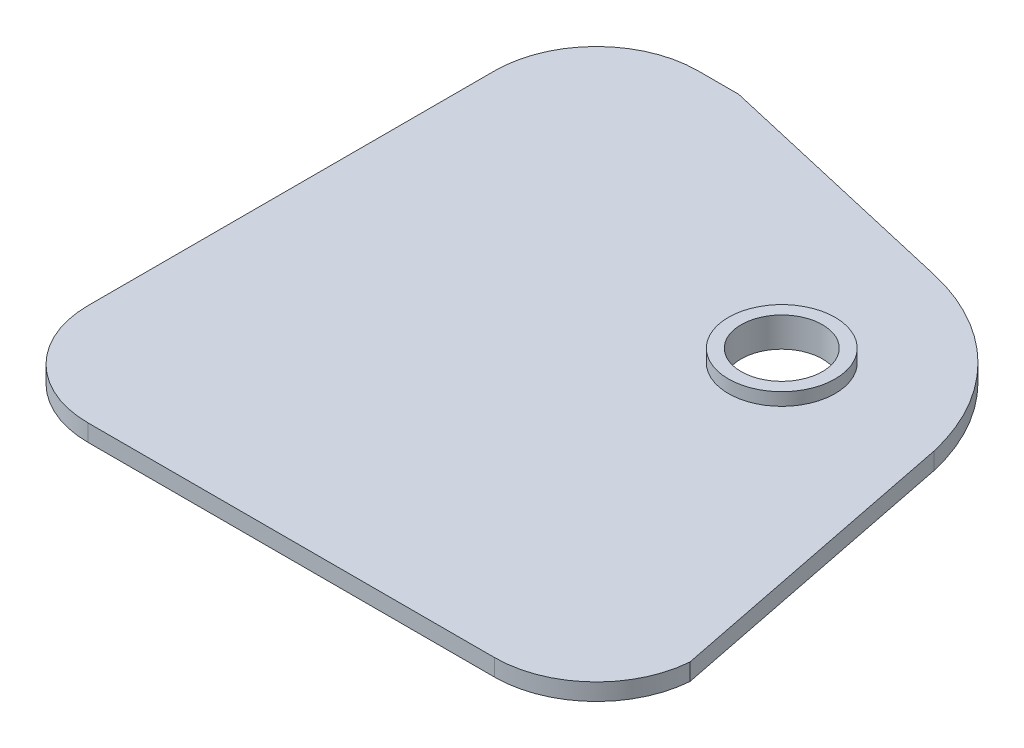
ISO-10303-21;
HEADER;
FILE_DESCRIPTION(('STEP AP214'),'2;1');
FILE_NAME('part.step','',(''),(''),'','','');
FILE_SCHEMA(('AUTOMOTIVE_DESIGN { 1 0 10303 214 1 1 1 1 }'));
ENDSEC;
DATA;
#1=APPLICATION_CONTEXT('core data for automotive mechanical design processes');
#2=APPLICATION_PROTOCOL_DEFINITION('international standard','automotive_design',2000,#1);
#3=PRODUCT_CONTEXT('',#1,'mechanical');
#4=PRODUCT('Part','Part','',(#3));
#5=PRODUCT_RELATED_PRODUCT_CATEGORY('part','',(#4));
#6=PRODUCT_DEFINITION_FORMATION('','',#4);
#7=PRODUCT_DEFINITION_CONTEXT('part definition',#1,'design');
#8=PRODUCT_DEFINITION('design','',#6,#7);
#9=PRODUCT_DEFINITION_SHAPE('','',#8);
#10=(LENGTH_UNIT() NAMED_UNIT(*) SI_UNIT(.MILLI.,.METRE.));
#11=(NAMED_UNIT(*) PLANE_ANGLE_UNIT() SI_UNIT($,.RADIAN.));
#12=(NAMED_UNIT(*) SI_UNIT($,.STERADIAN.) SOLID_ANGLE_UNIT());
#13=UNCERTAINTY_MEASURE_WITH_UNIT(LENGTH_MEASURE(1.E-05),#10,'distance_accuracy_value','');
#14=(GEOMETRIC_REPRESENTATION_CONTEXT(3) GLOBAL_UNCERTAINTY_ASSIGNED_CONTEXT((#13)) GLOBAL_UNIT_ASSIGNED_CONTEXT((#10,
#11,#12)) REPRESENTATION_CONTEXT('',''));
#15=CARTESIAN_POINT('',(0.,0.,0.));
#16=DIRECTION('',(0.,0.,1.));
#17=DIRECTION('',(1.,0.,0.));
#18=AXIS2_PLACEMENT_3D('',#15,#16,#17);
#19=CARTESIAN_POINT('',(-25.4,2.11666666666667,-38.1));
#20=DIRECTION('',(0.,-1.,0.));
#21=DIRECTION('',(0.,0.,-1.));
#22=AXIS2_PLACEMENT_3D('',#19,#20,#21);
#23=PLANE('',#22);
#24=CARTESIAN_POINT('',(-25.4,2.11666666666667,-38.1));
#25=DIRECTION('',(0.,1.,0.));
#26=DIRECTION('',(0.,0.,-1.));
#27=AXIS2_PLACEMENT_3D('',#24,#25,#26);
#28=CIRCLE('',#27,12.7);
#29=CARTESIAN_POINT('',(-25.4,2.11666666666667,-50.8));
#30=VERTEX_POINT('',#29);
#31=CARTESIAN_POINT('',(-38.1,2.11666666666667,-38.1));
#32=VERTEX_POINT('',#31);
#33=EDGE_CURVE('E180',#30,#32,#28,.T.);
#34=ORIENTED_EDGE('',*,*,#33,.T.);
#35=DIRECTION('',(0.,0.,1.));
#36=VECTOR('',#35,1.);
#37=CARTESIAN_POINT('',(-38.1,2.11666666666667,-38.1));
#38=LINE('',#37,#36);
#39=CARTESIAN_POINT('',(-38.1,2.11666666666667,12.7));
#40=VERTEX_POINT('',#39);
#41=EDGE_CURVE('E109',#32,#40,#38,.T.);
#42=ORIENTED_EDGE('',*,*,#41,.T.);
#43=CARTESIAN_POINT('',(-25.4,2.11666666666667,12.7));
#44=DIRECTION('',(0.,1.,0.));
#45=DIRECTION('',(0.,0.,1.));
#46=AXIS2_PLACEMENT_3D('',#43,#44,#45);
#47=CIRCLE('',#46,12.7);
#48=CARTESIAN_POINT('',(-25.4,2.11666666666667,25.4));
#49=VERTEX_POINT('',#48);
#50=EDGE_CURVE('E227',#40,#49,#47,.T.);
#51=ORIENTED_EDGE('',*,*,#50,.T.);
#52=DIRECTION('',(1.,0.,0.));
#53=VECTOR('',#52,1.);
#54=CARTESIAN_POINT('',(25.4,2.11666666666667,25.4));
#55=LINE('',#54,#53);
#56=CARTESIAN_POINT('',(25.4,2.11666666666667,25.4));
#57=VERTEX_POINT('',#56);
#58=EDGE_CURVE('E223',#49,#57,#55,.T.);
#59=ORIENTED_EDGE('',*,*,#58,.T.);
#60=CARTESIAN_POINT('',(25.4,2.11666666666667,12.7));
#61=DIRECTION('',(0.,1.,0.));
#62=DIRECTION('',(0.,0.,1.));
#63=AXIS2_PLACEMENT_3D('',#60,#61,#62);
#64=CIRCLE('',#63,12.7);
#65=CARTESIAN_POINT('',(38.0633710501394,2.11666666666667,13.6638639149234));
#66=VERTEX_POINT('',#65);
#67=EDGE_CURVE('E226',#57,#66,#64,.T.);
#68=ORIENTED_EDGE('',*,*,#67,.T.);
#69=DIRECTION('',(-0.195209422329643,0.,-0.980761582360222));
#70=VECTOR('',#69,1.);
#71=CARTESIAN_POINT('',(38.0633710501394,2.11666666666667,13.6638639149234));
#72=LINE('',#71,#70);
#73=CARTESIAN_POINT('',(30.48,2.11666666666667,-24.4361360850766));
#74=VERTEX_POINT('',#73);
#75=EDGE_CURVE('E131',#66,#74,#72,.T.);
#76=ORIENTED_EDGE('',*,*,#75,.T.);
#77=CARTESIAN_POINT('',(5.72823491348212,2.11666666666667,-18.7343709985587));
#78=DIRECTION('',(0.,1.,0.));
#79=DIRECTION('',(0.,0.,-1.));
#80=AXIS2_PLACEMENT_3D('',#77,#78,#79);
#81=CIRCLE('',#80,25.4);
#82=CARTESIAN_POINT('',(11.43,2.11666666666667,-43.4861360850766));
#83=VERTEX_POINT('',#82);
#84=EDGE_CURVE('E125',#74,#83,#81,.T.);
#85=ORIENTED_EDGE('',*,*,#84,.T.);
#86=DIRECTION('',(-0.97447894041409,0.,-0.22447894041409));
#87=VECTOR('',#86,1.);
#88=CARTESIAN_POINT('',(-20.3200000000003,2.11666666666667,-50.8));
#89=LINE('',#88,#87);
#90=CARTESIAN_POINT('',(-20.3200000000003,2.11666666666667,-50.8));
#91=VERTEX_POINT('',#90);
#92=EDGE_CURVE('E129',#83,#91,#89,.T.);
#93=ORIENTED_EDGE('',*,*,#92,.T.);
#94=DIRECTION('',(-1.,0.,0.));
#95=VECTOR('',#94,1.);
#96=CARTESIAN_POINT('',(-25.4,2.11666666666667,-50.8));
#97=LINE('',#96,#95);
#98=EDGE_CURVE('E62',#91,#30,#97,.T.);
#99=ORIENTED_EDGE('',*,*,#98,.T.);
#100=EDGE_LOOP('',(#34,#42,#51,#59,#68,#76,#85,#93,#99));
#101=FACE_BOUND('',#100,.T.);
#102=CARTESIAN_POINT('',(11.43,2.11666666666667,-24.4361360850766));
#103=DIRECTION('',(0.,-1.,0.));
#104=DIRECTION('',(0.,0.,-1.));
#105=AXIS2_PLACEMENT_3D('',#102,#103,#104);
#106=CIRCLE('',#105,6.6675);
#107=CARTESIAN_POINT('',(11.43,2.11666666666667,-31.1036360850766));
#108=VERTEX_POINT('',#107);
#109=EDGE_CURVE('E11',#108,#108,#106,.F.);
#110=ORIENTED_EDGE('',*,*,#109,.F.);
#111=EDGE_LOOP('',(#110));
#112=FACE_BOUND('',#111,.T.);
#113=ADVANCED_FACE('F44',(#101,#112),#23,.F.);
#114=CARTESIAN_POINT('',(-25.4,0.,-38.1));
#115=DIRECTION('',(0.,-1.,0.));
#116=DIRECTION('',(0.,0.,-1.));
#117=AXIS2_PLACEMENT_3D('',#114,#115,#116);
#118=PLANE('',#117);
#119=CARTESIAN_POINT('',(-25.4,0.,-38.1));
#120=DIRECTION('',(0.,1.,0.));
#121=DIRECTION('',(0.,0.,-1.));
#122=AXIS2_PLACEMENT_3D('',#119,#120,#121);
#123=CIRCLE('',#122,12.7);
#124=CARTESIAN_POINT('',(-25.4,0.,-50.8));
#125=VERTEX_POINT('',#124);
#126=CARTESIAN_POINT('',(-38.1,0.,-38.1));
#127=VERTEX_POINT('',#126);
#128=EDGE_CURVE('E154',#125,#127,#123,.T.);
#129=ORIENTED_EDGE('',*,*,#128,.F.);
#130=DIRECTION('',(-1.,0.,0.));
#131=VECTOR('',#130,1.);
#132=CARTESIAN_POINT('',(-25.4,0.,-50.8));
#133=LINE('',#132,#131);
#134=CARTESIAN_POINT('',(-20.3200000000003,0.,-50.8));
#135=VERTEX_POINT('',#134);
#136=EDGE_CURVE('E100',#135,#125,#133,.T.);
#137=ORIENTED_EDGE('',*,*,#136,.F.);
#138=DIRECTION('',(-0.97447894041409,0.,-0.22447894041409));
#139=VECTOR('',#138,1.);
#140=CARTESIAN_POINT('',(-20.3200000000003,0.,-50.8));
#141=LINE('',#140,#139);
#142=CARTESIAN_POINT('',(11.43,0.,-43.4861360850766));
#143=VERTEX_POINT('',#142);
#144=EDGE_CURVE('E94',#143,#135,#141,.T.);
#145=ORIENTED_EDGE('',*,*,#144,.F.);
#146=CARTESIAN_POINT('',(5.72823491348212,0.,-18.7343709985587));
#147=DIRECTION('',(0.,1.,0.));
#148=DIRECTION('',(0.,0.,-1.));
#149=AXIS2_PLACEMENT_3D('',#146,#147,#148);
#150=CIRCLE('',#149,25.4);
#151=CARTESIAN_POINT('',(30.48,0.,-24.4361360850766));
#152=VERTEX_POINT('',#151);
#153=EDGE_CURVE('E140',#152,#143,#150,.T.);
#154=ORIENTED_EDGE('',*,*,#153,.F.);
#155=DIRECTION('',(-0.195209422329643,0.,-0.980761582360222));
#156=VECTOR('',#155,1.);
#157=CARTESIAN_POINT('',(38.0633710501394,0.,13.6638639149234));
#158=LINE('',#157,#156);
#159=CARTESIAN_POINT('',(38.0633710501394,0.,13.6638639149234));
#160=VERTEX_POINT('',#159);
#161=EDGE_CURVE('E171',#160,#152,#158,.T.);
#162=ORIENTED_EDGE('',*,*,#161,.F.);
#163=CARTESIAN_POINT('',(25.4,0.,12.7));
#164=DIRECTION('',(0.,1.,0.));
#165=DIRECTION('',(0.,0.,1.));
#166=AXIS2_PLACEMENT_3D('',#163,#164,#165);
#167=CIRCLE('',#166,12.7);
#168=CARTESIAN_POINT('',(25.4,0.,25.4));
#169=VERTEX_POINT('',#168);
#170=EDGE_CURVE('E168',#169,#160,#167,.T.);
#171=ORIENTED_EDGE('',*,*,#170,.F.);
#172=DIRECTION('',(1.,0.,0.));
#173=VECTOR('',#172,1.);
#174=CARTESIAN_POINT('',(25.4,0.,25.4));
#175=LINE('',#174,#173);
#176=CARTESIAN_POINT('',(-25.4,0.,25.4));
#177=VERTEX_POINT('',#176);
#178=EDGE_CURVE('E165',#177,#169,#175,.T.);
#179=ORIENTED_EDGE('',*,*,#178,.F.);
#180=CARTESIAN_POINT('',(-25.4,0.,12.7));
#181=DIRECTION('',(0.,1.,0.));
#182=DIRECTION('',(0.,0.,1.));
#183=AXIS2_PLACEMENT_3D('',#180,#181,#182);
#184=CIRCLE('',#183,12.7);
#185=CARTESIAN_POINT('',(-38.1,0.,12.7));
#186=VERTEX_POINT('',#185);
#187=EDGE_CURVE('E162',#186,#177,#184,.T.);
#188=ORIENTED_EDGE('',*,*,#187,.F.);
#189=DIRECTION('',(0.,0.,1.));
#190=VECTOR('',#189,1.);
#191=CARTESIAN_POINT('',(-38.1,0.,-38.1));
#192=LINE('',#191,#190);
#193=EDGE_CURVE('E158',#127,#186,#192,.T.);
#194=ORIENTED_EDGE('',*,*,#193,.F.);
#195=EDGE_LOOP('',(#129,#137,#145,#154,#162,#171,#179,#188,#194));
#196=FACE_BOUND('',#195,.T.);
#197=CARTESIAN_POINT('',(11.43,0.,-24.4361360850766));
#198=DIRECTION('',(0.,1.,0.));
#199=DIRECTION('',(0.,0.,1.));
#200=AXIS2_PLACEMENT_3D('',#197,#198,#199);
#201=CIRCLE('',#200,5.08);
#202=CARTESIAN_POINT('',(11.43,0.,-19.3561360850766));
#203=VERTEX_POINT('',#202);
#204=EDGE_CURVE('E159',#203,#203,#201,.T.);
#205=ORIENTED_EDGE('',*,*,#204,.T.);
#206=EDGE_LOOP('',(#205));
#207=FACE_BOUND('',#206,.T.);
#208=ADVANCED_FACE('F210',(#196,#207),#118,.T.);
#209=CARTESIAN_POINT('',(-25.4,2.11666666666667,-38.1));
#210=DIRECTION('',(0.,-1.,0.));
#211=DIRECTION('',(0.,0.,-1.));
#212=AXIS2_PLACEMENT_3D('',#209,#210,#211);
#213=CYLINDRICAL_SURFACE('',#212,12.7);
#214=ORIENTED_EDGE('',*,*,#128,.T.);
#215=DIRECTION('',(0.,-1.,0.));
#216=VECTOR('',#215,1.);
#217=CARTESIAN_POINT('',(-38.1,2.11666666666667,-38.1));
#218=LINE('',#217,#216);
#219=EDGE_CURVE('E54',#32,#127,#218,.T.);
#220=ORIENTED_EDGE('',*,*,#219,.F.);
#221=ORIENTED_EDGE('',*,*,#33,.F.);
#222=DIRECTION('',(0.,-1.,0.));
#223=VECTOR('',#222,1.);
#224=CARTESIAN_POINT('',(-25.4,2.11666666666667,-50.8));
#225=LINE('',#224,#223);
#226=EDGE_CURVE('E150',#30,#125,#225,.T.);
#227=ORIENTED_EDGE('',*,*,#226,.T.);
#228=EDGE_LOOP('',(#214,#220,#221,#227));
#229=FACE_BOUND('',#228,.T.);
#230=ADVANCED_FACE('F46',(#229),#213,.T.);
#231=CARTESIAN_POINT('',(-38.1,2.11666666666667,-38.1));
#232=DIRECTION('',(1.,0.,0.));
#233=DIRECTION('',(0.,0.,-1.));
#234=AXIS2_PLACEMENT_3D('',#231,#232,#233);
#235=PLANE('',#234);
#236=ORIENTED_EDGE('',*,*,#193,.T.);
#237=DIRECTION('',(0.,-1.,0.));
#238=VECTOR('',#237,1.);
#239=CARTESIAN_POINT('',(-38.1,2.11666666666667,12.7));
#240=LINE('',#239,#238);
#241=EDGE_CURVE('E199',#40,#186,#240,.T.);
#242=ORIENTED_EDGE('',*,*,#241,.F.);
#243=ORIENTED_EDGE('',*,*,#41,.F.);
#244=ORIENTED_EDGE('',*,*,#219,.T.);
#245=EDGE_LOOP('',(#236,#242,#243,#244));
#246=FACE_BOUND('',#245,.T.);
#247=ADVANCED_FACE('F205',(#246),#235,.F.);
#248=CARTESIAN_POINT('',(-25.4,2.11666666666667,12.7));
#249=DIRECTION('',(0.,-1.,0.));
#250=DIRECTION('',(0.,0.,-1.));
#251=AXIS2_PLACEMENT_3D('',#248,#249,#250);
#252=CYLINDRICAL_SURFACE('',#251,12.7);
#253=ORIENTED_EDGE('',*,*,#187,.T.);
#254=DIRECTION('',(0.,-1.,0.));
#255=VECTOR('',#254,1.);
#256=CARTESIAN_POINT('',(-25.4,2.11666666666667,25.4));
#257=LINE('',#256,#255);
#258=EDGE_CURVE('E195',#49,#177,#257,.T.);
#259=ORIENTED_EDGE('',*,*,#258,.F.);
#260=ORIENTED_EDGE('',*,*,#50,.F.);
#261=ORIENTED_EDGE('',*,*,#241,.T.);
#262=EDGE_LOOP('',(#253,#259,#260,#261));
#263=FACE_BOUND('',#262,.T.);
#264=ADVANCED_FACE('F217',(#263),#252,.T.);
#265=CARTESIAN_POINT('',(25.4,2.11666666666667,25.4));
#266=DIRECTION('',(0.,0.,-1.));
#267=DIRECTION('',(-1.,0.,0.));
#268=AXIS2_PLACEMENT_3D('',#265,#266,#267);
#269=PLANE('',#268);
#270=ORIENTED_EDGE('',*,*,#178,.T.);
#271=DIRECTION('',(0.,-1.,0.));
#272=VECTOR('',#271,1.);
#273=CARTESIAN_POINT('',(25.4,2.11666666666667,25.4));
#274=LINE('',#273,#272);
#275=EDGE_CURVE('E191',#57,#169,#274,.T.);
#276=ORIENTED_EDGE('',*,*,#275,.F.);
#277=ORIENTED_EDGE('',*,*,#58,.F.);
#278=ORIENTED_EDGE('',*,*,#258,.T.);
#279=EDGE_LOOP('',(#270,#276,#277,#278));
#280=FACE_BOUND('',#279,.T.);
#281=ADVANCED_FACE('F221',(#280),#269,.F.);
#282=CARTESIAN_POINT('',(25.4,2.11666666666667,12.7));
#283=DIRECTION('',(0.,-1.,0.));
#284=DIRECTION('',(0.,0.,-1.));
#285=AXIS2_PLACEMENT_3D('',#282,#283,#284);
#286=CYLINDRICAL_SURFACE('',#285,12.7);
#287=ORIENTED_EDGE('',*,*,#170,.T.);
#288=DIRECTION('',(0.,-1.,0.));
#289=VECTOR('',#288,1.);
#290=CARTESIAN_POINT('',(38.0633710501394,2.11666666666667,13.6638639149234));
#291=LINE('',#290,#289);
#292=EDGE_CURVE('E187',#66,#160,#291,.T.);
#293=ORIENTED_EDGE('',*,*,#292,.F.);
#294=ORIENTED_EDGE('',*,*,#67,.F.);
#295=ORIENTED_EDGE('',*,*,#275,.T.);
#296=EDGE_LOOP('',(#287,#293,#294,#295));
#297=FACE_BOUND('',#296,.T.);
#298=ADVANCED_FACE('F288',(#297),#286,.T.);
#299=CARTESIAN_POINT('',(38.0633710501394,2.11666666666667,13.6638639149234));
#300=DIRECTION('',(-0.980761582360222,0.,0.195209422329643));
#301=DIRECTION('',(0.195209422329644,0.,0.980761582360222));
#302=AXIS2_PLACEMENT_3D('',#299,#300,#301);
#303=PLANE('',#302);
#304=ORIENTED_EDGE('',*,*,#161,.T.);
#305=DIRECTION('',(0.,-1.,0.));
#306=VECTOR('',#305,1.);
#307=CARTESIAN_POINT('',(30.48,2.11666666666667,-24.4361360850766));
#308=LINE('',#307,#306);
#309=EDGE_CURVE('E142',#74,#152,#308,.T.);
#310=ORIENTED_EDGE('',*,*,#309,.F.);
#311=ORIENTED_EDGE('',*,*,#75,.F.);
#312=ORIENTED_EDGE('',*,*,#292,.T.);
#313=EDGE_LOOP('',(#304,#310,#311,#312));
#314=FACE_BOUND('',#313,.T.);
#315=ADVANCED_FACE('F285',(#314),#303,.F.);
#316=CARTESIAN_POINT('',(5.72823491348212,2.11666666666667,-18.7343709985587));
#317=DIRECTION('',(0.,-1.,0.));
#318=DIRECTION('',(0.,0.,-1.));
#319=AXIS2_PLACEMENT_3D('',#316,#317,#318);
#320=CYLINDRICAL_SURFACE('',#319,25.4);
#321=ORIENTED_EDGE('',*,*,#153,.T.);
#322=DIRECTION('',(0.,-1.,0.));
#323=VECTOR('',#322,1.);
#324=CARTESIAN_POINT('',(11.43,2.11666666666667,-43.4861360850766));
#325=LINE('',#324,#323);
#326=EDGE_CURVE('E137',#83,#143,#325,.T.);
#327=ORIENTED_EDGE('',*,*,#326,.F.);
#328=ORIENTED_EDGE('',*,*,#84,.F.);
#329=ORIENTED_EDGE('',*,*,#309,.T.);
#330=EDGE_LOOP('',(#321,#327,#328,#329));
#331=FACE_BOUND('',#330,.T.);
#332=ADVANCED_FACE('F138',(#331),#320,.T.);
#333=CARTESIAN_POINT('',(-20.3200000000003,2.11666666666667,-50.8));
#334=DIRECTION('',(-0.22447894041409,0.,0.97447894041409));
#335=DIRECTION('',(0.97447894041409,0.,0.22447894041409));
#336=AXIS2_PLACEMENT_3D('',#333,#334,#335);
#337=PLANE('',#336);
#338=ORIENTED_EDGE('',*,*,#144,.T.);
#339=DIRECTION('',(0.,-1.,0.));
#340=VECTOR('',#339,1.);
#341=CARTESIAN_POINT('',(-20.3200000000003,2.11666666666667,-50.8));
#342=LINE('',#341,#340);
#343=EDGE_CURVE('E143',#91,#135,#342,.T.);
#344=ORIENTED_EDGE('',*,*,#343,.F.);
#345=ORIENTED_EDGE('',*,*,#92,.F.);
#346=ORIENTED_EDGE('',*,*,#326,.T.);
#347=EDGE_LOOP('',(#338,#344,#345,#346));
#348=FACE_BOUND('',#347,.T.);
#349=ADVANCED_FACE('F145',(#348),#337,.F.);
#350=CARTESIAN_POINT('',(-25.4,2.11666666666667,-50.8));
#351=DIRECTION('',(0.,0.,1.));
#352=DIRECTION('',(1.,0.,0.));
#353=AXIS2_PLACEMENT_3D('',#350,#351,#352);
#354=PLANE('',#353);
#355=ORIENTED_EDGE('',*,*,#136,.T.);
#356=ORIENTED_EDGE('',*,*,#226,.F.);
#357=ORIENTED_EDGE('',*,*,#98,.F.);
#358=ORIENTED_EDGE('',*,*,#343,.T.);
#359=EDGE_LOOP('',(#355,#356,#357,#358));
#360=FACE_BOUND('',#359,.T.);
#361=ADVANCED_FACE('F269',(#360),#354,.F.);
#362=CARTESIAN_POINT('',(11.43,2.11666666666667,-24.4361360850766));
#363=DIRECTION('',(0.,-1.,0.));
#364=DIRECTION('',(0.,0.,-1.));
#365=AXIS2_PLACEMENT_3D('',#362,#363,#364);
#366=CYLINDRICAL_SURFACE('',#365,5.08);
#367=ORIENTED_EDGE('',*,*,#204,.F.);
#368=EDGE_LOOP('',(#367));
#369=FACE_BOUND('',#368,.T.);
#370=CARTESIAN_POINT('',(11.43,3.70416666666667,-24.4361360850766));
#371=DIRECTION('',(0.,1.,0.));
#372=DIRECTION('',(0.,0.,1.));
#373=AXIS2_PLACEMENT_3D('',#370,#371,#372);
#374=CIRCLE('',#373,5.08);
#375=CARTESIAN_POINT('',(11.43,3.70416666666667,-19.3561360850766));
#376=VERTEX_POINT('',#375);
#377=EDGE_CURVE('E250',#376,#376,#374,.T.);
#378=ORIENTED_EDGE('',*,*,#377,.T.);
#379=EDGE_LOOP('',(#378));
#380=FACE_BOUND('',#379,.T.);
#381=ADVANCED_FACE('F256',(#369,#380),#366,.F.);
#382=CARTESIAN_POINT('',(11.43,3.70416666666667,-24.4361360850766));
#383=DIRECTION('',(0.,1.,0.));
#384=DIRECTION('',(0.,0.,1.));
#385=AXIS2_PLACEMENT_3D('',#382,#383,#384);
#386=PLANE('',#385);
#387=CARTESIAN_POINT('',(11.43,3.70416666666667,-24.4361360850766));
#388=DIRECTION('',(0.,1.,0.));
#389=DIRECTION('',(0.,0.,1.));
#390=AXIS2_PLACEMENT_3D('',#387,#388,#389);
#391=CIRCLE('',#390,6.6675);
#392=CARTESIAN_POINT('',(11.43,3.70416666666667,-17.7686360850766));
#393=VERTEX_POINT('',#392);
#394=EDGE_CURVE('E246',#393,#393,#391,.T.);
#395=ORIENTED_EDGE('',*,*,#394,.T.);
#396=EDGE_LOOP('',(#395));
#397=FACE_BOUND('',#396,.T.);
#398=ORIENTED_EDGE('',*,*,#377,.F.);
#399=EDGE_LOOP('',(#398));
#400=FACE_BOUND('',#399,.T.);
#401=ADVANCED_FACE('F258',(#397,#400),#386,.T.);
#402=CARTESIAN_POINT('',(11.43,3.70416666666667,-24.4361360850766));
#403=DIRECTION('',(0.,-1.,0.));
#404=DIRECTION('',(0.,0.,-1.));
#405=AXIS2_PLACEMENT_3D('',#402,#403,#404);
#406=CYLINDRICAL_SURFACE('',#405,6.6675);
#407=ORIENTED_EDGE('',*,*,#394,.F.);
#408=EDGE_LOOP('',(#407));
#409=FACE_BOUND('',#408,.T.);
#410=ORIENTED_EDGE('',*,*,#109,.T.);
#411=EDGE_LOOP('',(#410));
#412=FACE_BOUND('',#411,.T.);
#413=ADVANCED_FACE('F260',(#409,#412),#406,.T.);
#414=CLOSED_SHELL('',(#113,#208,#230,#247,#264,#281,#298,#315,#332,#349,#361,#381,#401,#413));
#415=MANIFOLD_SOLID_BREP('B2',#414);
#416=ADVANCED_BREP_SHAPE_REPRESENTATION('',(#18,#415),#14);
#417=SHAPE_DEFINITION_REPRESENTATION(#9,#416);
ENDSEC;
END-ISO-10303-21;
